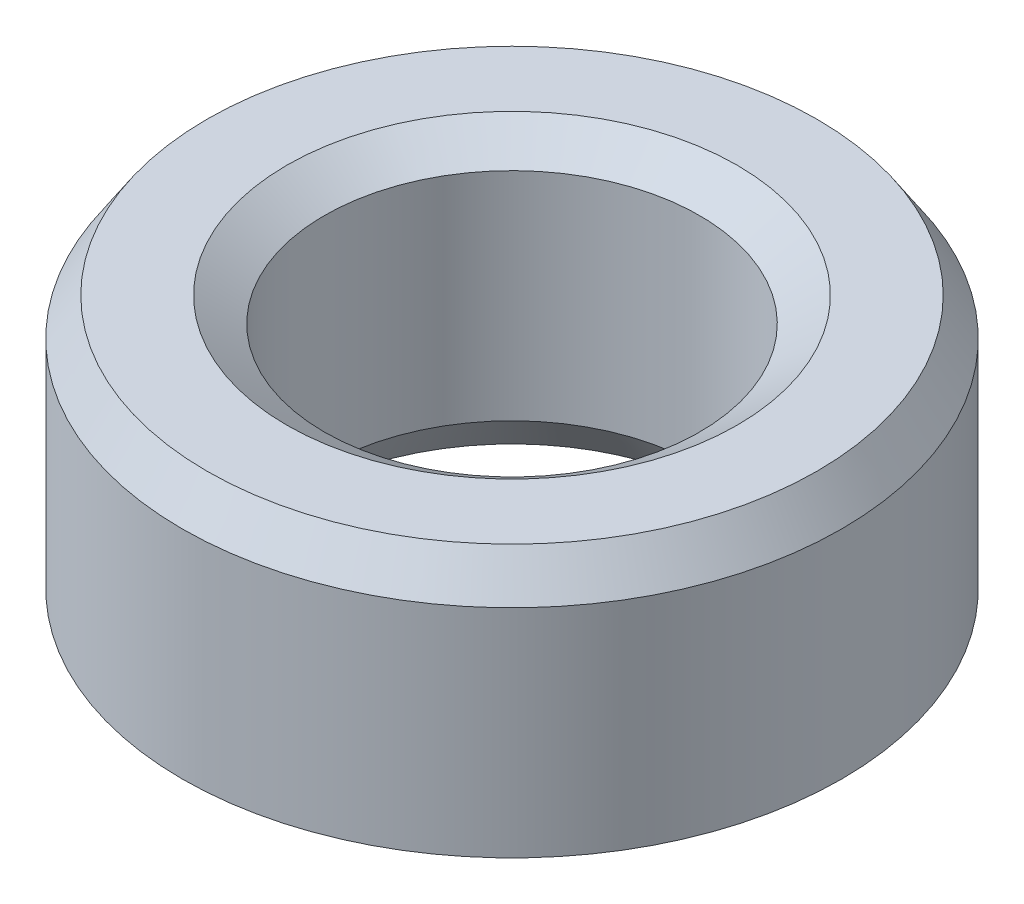
ISO-10303-21;
HEADER;
FILE_DESCRIPTION(('STEP AP214'),'2;1');
FILE_NAME('part.step','',(''),(''),'','','');
FILE_SCHEMA(('AUTOMOTIVE_DESIGN { 1 0 10303 214 1 1 1 1 }'));
ENDSEC;
DATA;
#1=APPLICATION_CONTEXT('core data for automotive mechanical design processes');
#2=APPLICATION_PROTOCOL_DEFINITION('international standard','automotive_design',2000,#1);
#3=PRODUCT_CONTEXT('',#1,'mechanical');
#4=PRODUCT('Part','Part','',(#3));
#5=PRODUCT_RELATED_PRODUCT_CATEGORY('part','',(#4));
#6=PRODUCT_DEFINITION_FORMATION('','',#4);
#7=PRODUCT_DEFINITION_CONTEXT('part definition',#1,'design');
#8=PRODUCT_DEFINITION('design','',#6,#7);
#9=PRODUCT_DEFINITION_SHAPE('','',#8);
#10=(LENGTH_UNIT() NAMED_UNIT(*) SI_UNIT(.MILLI.,.METRE.));
#11=(NAMED_UNIT(*) PLANE_ANGLE_UNIT() SI_UNIT($,.RADIAN.));
#12=(NAMED_UNIT(*) SI_UNIT($,.STERADIAN.) SOLID_ANGLE_UNIT());
#13=UNCERTAINTY_MEASURE_WITH_UNIT(LENGTH_MEASURE(1.E-05),#10,'distance_accuracy_value','');
#14=(GEOMETRIC_REPRESENTATION_CONTEXT(3) GLOBAL_UNCERTAINTY_ASSIGNED_CONTEXT((#13)) GLOBAL_UNIT_ASSIGNED_CONTEXT((#10,
#11,#12)) REPRESENTATION_CONTEXT('',''));
#15=CARTESIAN_POINT('',(0.,0.,0.));
#16=DIRECTION('',(0.,0.,1.));
#17=DIRECTION('',(1.,0.,0.));
#18=AXIS2_PLACEMENT_3D('',#15,#16,#17);
#19=CARTESIAN_POINT('',(0.,19.0381970714813,0.));
#20=DIRECTION('',(0.,-1.,0.));
#21=DIRECTION('',(0.,0.,-1.));
#22=AXIS2_PLACEMENT_3D('',#19,#20,#21);
#23=CYLINDRICAL_SURFACE('',#22,22.5);
#24=CARTESIAN_POINT('',(0.,1.69020873276425,0.));
#25=DIRECTION('',(0.,1.,0.));
#26=DIRECTION('',(0.,0.,1.));
#27=AXIS2_PLACEMENT_3D('',#24,#25,#26);
#28=CIRCLE('',#27,22.5);
#29=CARTESIAN_POINT('',(0.,1.69020873276425,22.5));
#30=VERTEX_POINT('',#29);
#31=EDGE_CURVE('E10',#30,#30,#28,.T.);
#32=ORIENTED_EDGE('',*,*,#31,.T.);
#33=EDGE_LOOP('',(#32));
#34=FACE_BOUND('',#33,.T.);
#35=CARTESIAN_POINT('',(0.,16.4737954826424,0.));
#36=DIRECTION('',(0.,1.,0.));
#37=DIRECTION('',(0.,0.,1.));
#38=AXIS2_PLACEMENT_3D('',#35,#36,#37);
#39=CIRCLE('',#38,22.5);
#40=CARTESIAN_POINT('',(0.,16.4737954826424,22.5));
#41=VERTEX_POINT('',#40);
#42=EDGE_CURVE('E50',#41,#41,#39,.F.);
#43=ORIENTED_EDGE('',*,*,#42,.T.);
#44=EDGE_LOOP('',(#43));
#45=FACE_BOUND('',#44,.T.);
#46=ADVANCED_FACE('F39',(#34,#45),#23,.T.);
#47=CARTESIAN_POINT('',(0.,19.0381970714813,0.));
#48=DIRECTION('',(0.,1.,0.));
#49=DIRECTION('',(0.,0.,1.));
#50=AXIS2_PLACEMENT_3D('',#47,#48,#49);
#51=PLANE('',#50);
#52=CARTESIAN_POINT('',(0.,19.0381970714813,0.));
#53=DIRECTION('',(0.,1.,0.));
#54=DIRECTION('',(0.,0.,1.));
#55=AXIS2_PLACEMENT_3D('',#52,#53,#54);
#56=CIRCLE('',#55,15.3669609758685);
#57=CARTESIAN_POINT('',(0.,19.0381970714813,15.3669609758685));
#58=VERTEX_POINT('',#57);
#59=EDGE_CURVE('E58',#58,#58,#56,.F.);
#60=ORIENTED_EDGE('',*,*,#59,.T.);
#61=EDGE_LOOP('',(#60));
#62=FACE_BOUND('',#61,.T.);
#63=CARTESIAN_POINT('',(0.,19.0381970714813,0.));
#64=DIRECTION('',(0.,1.,0.));
#65=DIRECTION('',(0.,0.,1.));
#66=AXIS2_PLACEMENT_3D('',#63,#64,#65);
#67=CIRCLE('',#66,20.8097912672357);
#68=CARTESIAN_POINT('',(0.,19.0381970714813,20.8097912672357));
#69=VERTEX_POINT('',#68);
#70=EDGE_CURVE('E61',#69,#69,#67,.T.);
#71=ORIENTED_EDGE('',*,*,#70,.T.);
#72=EDGE_LOOP('',(#71));
#73=FACE_BOUND('',#72,.T.);
#74=ADVANCED_FACE('F88',(#62,#73),#51,.T.);
#75=CARTESIAN_POINT('',(0.,0.,0.));
#76=DIRECTION('',(0.,1.,0.));
#77=DIRECTION('',(0.,0.,1.));
#78=AXIS2_PLACEMENT_3D('',#75,#76,#77);
#79=PLANE('',#78);
#80=CARTESIAN_POINT('',(0.,0.,0.));
#81=DIRECTION('',(0.,1.,0.));
#82=DIRECTION('',(0.,0.,1.));
#83=AXIS2_PLACEMENT_3D('',#80,#81,#82);
#84=CIRCLE('',#83,14.4927681197939);
#85=CARTESIAN_POINT('',(0.,0.,14.4927681197939));
#86=VERTEX_POINT('',#85);
#87=EDGE_CURVE('E51',#86,#86,#84,.T.);
#88=ORIENTED_EDGE('',*,*,#87,.T.);
#89=EDGE_LOOP('',(#88));
#90=FACE_BOUND('',#89,.T.);
#91=CARTESIAN_POINT('',(0.,0.,0.));
#92=DIRECTION('',(0.,1.,0.));
#93=DIRECTION('',(0.,0.,1.));
#94=AXIS2_PLACEMENT_3D('',#91,#92,#93);
#95=CIRCLE('',#94,19.9355984111612);
#96=CARTESIAN_POINT('',(0.,0.,19.9355984111612));
#97=VERTEX_POINT('',#96);
#98=EDGE_CURVE('E54',#97,#97,#95,.F.);
#99=ORIENTED_EDGE('',*,*,#98,.T.);
#100=EDGE_LOOP('',(#99));
#101=FACE_BOUND('',#100,.T.);
#102=ADVANCED_FACE('F83',(#90,#101),#79,.F.);
#103=CARTESIAN_POINT('',(0.,19.0381970714813,0.));
#104=DIRECTION('',(0.,-1.,0.));
#105=DIRECTION('',(0.,0.,-1.));
#106=AXIS2_PLACEMENT_3D('',#103,#104,#105);
#107=CYLINDRICAL_SURFACE('',#106,12.8025593870296);
#108=CARTESIAN_POINT('',(0.,17.347988338717,0.));
#109=DIRECTION('',(0.,1.,0.));
#110=DIRECTION('',(0.,0.,1.));
#111=AXIS2_PLACEMENT_3D('',#108,#109,#110);
#112=CIRCLE('',#111,12.8025593870296);
#113=CARTESIAN_POINT('',(0.,17.347988338717,12.8025593870296));
#114=VERTEX_POINT('',#113);
#115=EDGE_CURVE('E67',#114,#114,#112,.T.);
#116=ORIENTED_EDGE('',*,*,#115,.T.);
#117=EDGE_LOOP('',(#116));
#118=FACE_BOUND('',#117,.T.);
#119=CARTESIAN_POINT('',(0.,2.56440158883885,0.));
#120=DIRECTION('',(0.,1.,0.));
#121=DIRECTION('',(0.,0.,1.));
#122=AXIS2_PLACEMENT_3D('',#119,#120,#121);
#123=CIRCLE('',#122,12.8025593870296);
#124=CARTESIAN_POINT('',(0.,2.56440158883885,12.8025593870296));
#125=VERTEX_POINT('',#124);
#126=EDGE_CURVE('E69',#125,#125,#123,.F.);
#127=ORIENTED_EDGE('',*,*,#126,.T.);
#128=EDGE_LOOP('',(#127));
#129=FACE_BOUND('',#128,.T.);
#130=ADVANCED_FACE('F71',(#118,#129),#107,.F.);
#131=CARTESIAN_POINT('',(0.,17.347988338717,0.));
#132=DIRECTION('',(0.,1.,0.));
#133=DIRECTION('',(0.,0.,1.));
#134=AXIS2_PLACEMENT_3D('',#131,#132,#133);
#135=CONICAL_SURFACE('',#134,12.8025593870296,0.98804732888146);
#136=ORIENTED_EDGE('',*,*,#59,.F.);
#137=EDGE_LOOP('',(#136));
#138=FACE_BOUND('',#137,.T.);
#139=ORIENTED_EDGE('',*,*,#115,.F.);
#140=EDGE_LOOP('',(#139));
#141=FACE_BOUND('',#140,.T.);
#142=ADVANCED_FACE('F77',(#138,#141),#135,.F.);
#143=CARTESIAN_POINT('',(0.,0.,0.));
#144=DIRECTION('',(0.,-1.,0.));
#145=DIRECTION('',(0.,0.,-1.));
#146=AXIS2_PLACEMENT_3D('',#143,#144,#145);
#147=CONICAL_SURFACE('',#146,14.4927681197939,0.582748997913437);
#148=ORIENTED_EDGE('',*,*,#126,.F.);
#149=EDGE_LOOP('',(#148));
#150=FACE_BOUND('',#149,.T.);
#151=ORIENTED_EDGE('',*,*,#87,.F.);
#152=EDGE_LOOP('',(#151));
#153=FACE_BOUND('',#152,.T.);
#154=ADVANCED_FACE('F73',(#150,#153),#147,.F.);
#155=CARTESIAN_POINT('',(0.,1.69020873276425,0.));
#156=DIRECTION('',(0.,1.,0.));
#157=DIRECTION('',(0.,0.,1.));
#158=AXIS2_PLACEMENT_3D('',#155,#156,#157);
#159=CONICAL_SURFACE('',#158,22.5,0.988047328881459);
#160=ORIENTED_EDGE('',*,*,#98,.F.);
#161=EDGE_LOOP('',(#160));
#162=FACE_BOUND('',#161,.T.);
#163=ORIENTED_EDGE('',*,*,#31,.F.);
#164=EDGE_LOOP('',(#163));
#165=FACE_BOUND('',#164,.T.);
#166=ADVANCED_FACE('F76',(#162,#165),#159,.T.);
#167=CARTESIAN_POINT('',(0.,19.0381970714813,0.));
#168=DIRECTION('',(0.,-1.,0.));
#169=DIRECTION('',(0.,0.,-1.));
#170=AXIS2_PLACEMENT_3D('',#167,#168,#169);
#171=CONICAL_SURFACE('',#170,20.8097912672357,0.582748997913437);
#172=ORIENTED_EDGE('',*,*,#42,.F.);
#173=EDGE_LOOP('',(#172));
#174=FACE_BOUND('',#173,.T.);
#175=ORIENTED_EDGE('',*,*,#70,.F.);
#176=EDGE_LOOP('',(#175));
#177=FACE_BOUND('',#176,.T.);
#178=ADVANCED_FACE('F45',(#174,#177),#171,.T.);
#179=CLOSED_SHELL('',(#46,#74,#102,#130,#142,#154,#166,#178));
#180=MANIFOLD_SOLID_BREP('B2',#179);
#181=ADVANCED_BREP_SHAPE_REPRESENTATION('',(#18,#180),#14);
#182=SHAPE_DEFINITION_REPRESENTATION(#9,#181);
ENDSEC;
END-ISO-10303-21;
